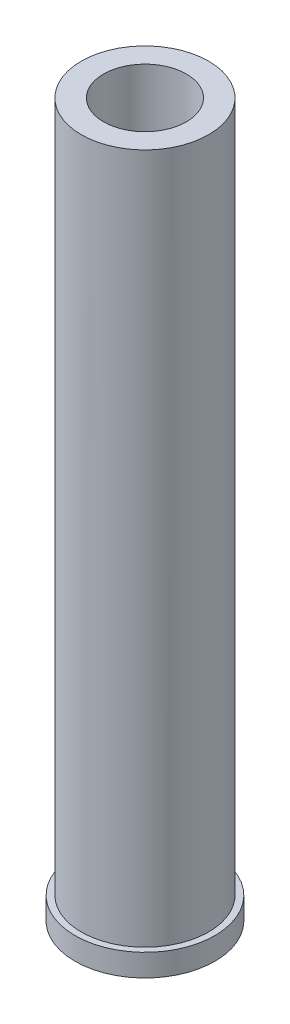
ISO-10303-21;
HEADER;
FILE_DESCRIPTION(('STEP AP214'),'2;1');
FILE_NAME('part.step','',(''),(''),'','','');
FILE_SCHEMA(('AUTOMOTIVE_DESIGN { 1 0 10303 214 1 1 1 1 }'));
ENDSEC;
DATA;
#1=APPLICATION_CONTEXT('core data for automotive mechanical design processes');
#2=APPLICATION_PROTOCOL_DEFINITION('international standard','automotive_design',2000,#1);
#3=PRODUCT_CONTEXT('',#1,'mechanical');
#4=PRODUCT('Part','Part','',(#3));
#5=PRODUCT_RELATED_PRODUCT_CATEGORY('part','',(#4));
#6=PRODUCT_DEFINITION_FORMATION('','',#4);
#7=PRODUCT_DEFINITION_CONTEXT('part definition',#1,'design');
#8=PRODUCT_DEFINITION('design','',#6,#7);
#9=PRODUCT_DEFINITION_SHAPE('','',#8);
#10=(LENGTH_UNIT() NAMED_UNIT(*) SI_UNIT(.MILLI.,.METRE.));
#11=(NAMED_UNIT(*) PLANE_ANGLE_UNIT() SI_UNIT($,.RADIAN.));
#12=(NAMED_UNIT(*) SI_UNIT($,.STERADIAN.) SOLID_ANGLE_UNIT());
#13=UNCERTAINTY_MEASURE_WITH_UNIT(LENGTH_MEASURE(1.E-05),#10,'distance_accuracy_value','');
#14=(GEOMETRIC_REPRESENTATION_CONTEXT(3) GLOBAL_UNCERTAINTY_ASSIGNED_CONTEXT((#13)) GLOBAL_UNIT_ASSIGNED_CONTEXT((#10,
#11,#12)) REPRESENTATION_CONTEXT('',''));
#15=CARTESIAN_POINT('',(0.,0.,0.));
#16=DIRECTION('',(0.,0.,1.));
#17=DIRECTION('',(1.,0.,0.));
#18=AXIS2_PLACEMENT_3D('',#15,#16,#17);
#19=CARTESIAN_POINT('',(0.,160.,0.));
#20=DIRECTION('',(0.,-1.,0.));
#21=DIRECTION('',(0.,0.,-1.));
#22=AXIS2_PLACEMENT_3D('',#19,#20,#21);
#23=CYLINDRICAL_SURFACE('',#22,14.3);
#24=CARTESIAN_POINT('',(0.,160.,0.));
#25=DIRECTION('',(0.,1.,0.));
#26=DIRECTION('',(0.,0.,1.));
#27=AXIS2_PLACEMENT_3D('',#24,#25,#26);
#28=CIRCLE('',#27,14.3);
#29=CARTESIAN_POINT('',(0.,160.,14.3));
#30=VERTEX_POINT('',#29);
#31=EDGE_CURVE('E54',#30,#30,#28,.T.);
#32=ORIENTED_EDGE('',*,*,#31,.F.);
#33=EDGE_LOOP('',(#32));
#34=FACE_BOUND('',#33,.T.);
#35=CARTESIAN_POINT('',(0.,5.,0.));
#36=DIRECTION('',(0.,-1.,0.));
#37=DIRECTION('',(0.,0.,-1.));
#38=AXIS2_PLACEMENT_3D('',#35,#36,#37);
#39=CIRCLE('',#38,14.3);
#40=CARTESIAN_POINT('',(0.,5.,-14.3));
#41=VERTEX_POINT('',#40);
#42=EDGE_CURVE('E10',#41,#41,#39,.T.);
#43=ORIENTED_EDGE('',*,*,#42,.F.);
#44=EDGE_LOOP('',(#43));
#45=FACE_BOUND('',#44,.T.);
#46=ADVANCED_FACE('F47',(#34,#45),#23,.T.);
#47=CARTESIAN_POINT('',(0.,160.,0.));
#48=DIRECTION('',(0.,1.,0.));
#49=DIRECTION('',(0.,0.,1.));
#50=AXIS2_PLACEMENT_3D('',#47,#48,#49);
#51=PLANE('',#50);
#52=ORIENTED_EDGE('',*,*,#31,.T.);
#53=EDGE_LOOP('',(#52));
#54=FACE_BOUND('',#53,.T.);
#55=CARTESIAN_POINT('',(0.,160.,0.));
#56=DIRECTION('',(0.,1.,0.));
#57=DIRECTION('',(0.,0.,1.));
#58=AXIS2_PLACEMENT_3D('',#55,#56,#57);
#59=CIRCLE('',#58,9.3);
#60=CARTESIAN_POINT('',(0.,160.,9.3));
#61=VERTEX_POINT('',#60);
#62=EDGE_CURVE('E59',#61,#61,#59,.T.);
#63=ORIENTED_EDGE('',*,*,#62,.F.);
#64=EDGE_LOOP('',(#63));
#65=FACE_BOUND('',#64,.T.);
#66=ADVANCED_FACE('F85',(#54,#65),#51,.T.);
#67=CARTESIAN_POINT('',(0.,0.,0.));
#68=DIRECTION('',(0.,1.,0.));
#69=DIRECTION('',(0.,0.,1.));
#70=AXIS2_PLACEMENT_3D('',#67,#68,#69);
#71=PLANE('',#70);
#72=CARTESIAN_POINT('',(0.,0.,0.));
#73=DIRECTION('',(0.,1.,0.));
#74=DIRECTION('',(0.,0.,1.));
#75=AXIS2_PLACEMENT_3D('',#72,#73,#74);
#76=CIRCLE('',#75,9.3);
#77=CARTESIAN_POINT('',(0.,0.,9.3));
#78=VERTEX_POINT('',#77);
#79=EDGE_CURVE('E64',#78,#78,#76,.T.);
#80=ORIENTED_EDGE('',*,*,#79,.T.);
#81=EDGE_LOOP('',(#80));
#82=FACE_BOUND('',#81,.T.);
#83=CARTESIAN_POINT('',(0.,0.,0.));
#84=DIRECTION('',(0.,1.,0.));
#85=DIRECTION('',(0.,0.,1.));
#86=AXIS2_PLACEMENT_3D('',#83,#84,#85);
#87=CIRCLE('',#86,15.7);
#88=CARTESIAN_POINT('',(0.,0.,15.7));
#89=VERTEX_POINT('',#88);
#90=EDGE_CURVE('E74',#89,#89,#87,.T.);
#91=ORIENTED_EDGE('',*,*,#90,.F.);
#92=EDGE_LOOP('',(#91));
#93=FACE_BOUND('',#92,.T.);
#94=ADVANCED_FACE('F82',(#82,#93),#71,.F.);
#95=CARTESIAN_POINT('',(0.,160.,0.));
#96=DIRECTION('',(0.,-1.,0.));
#97=DIRECTION('',(0.,0.,-1.));
#98=AXIS2_PLACEMENT_3D('',#95,#96,#97);
#99=CYLINDRICAL_SURFACE('',#98,9.3);
#100=ORIENTED_EDGE('',*,*,#62,.T.);
#101=EDGE_LOOP('',(#100));
#102=FACE_BOUND('',#101,.T.);
#103=ORIENTED_EDGE('',*,*,#79,.F.);
#104=EDGE_LOOP('',(#103));
#105=FACE_BOUND('',#104,.T.);
#106=ADVANCED_FACE('F84',(#102,#105),#99,.F.);
#107=CARTESIAN_POINT('',(0.,5.,0.));
#108=DIRECTION('',(0.,-1.,0.));
#109=DIRECTION('',(0.,0.,-1.));
#110=AXIS2_PLACEMENT_3D('',#107,#108,#109);
#111=PLANE('',#110);
#112=ORIENTED_EDGE('',*,*,#42,.T.);
#113=EDGE_LOOP('',(#112));
#114=FACE_BOUND('',#113,.T.);
#115=CARTESIAN_POINT('',(0.,5.,0.));
#116=DIRECTION('',(0.,1.,0.));
#117=DIRECTION('',(0.,0.,1.));
#118=AXIS2_PLACEMENT_3D('',#115,#116,#117);
#119=CIRCLE('',#118,15.7);
#120=CARTESIAN_POINT('',(0.,5.,15.7));
#121=VERTEX_POINT('',#120);
#122=EDGE_CURVE('E69',#121,#121,#119,.T.);
#123=ORIENTED_EDGE('',*,*,#122,.T.);
#124=EDGE_LOOP('',(#123));
#125=FACE_BOUND('',#124,.T.);
#126=ADVANCED_FACE('F92',(#114,#125),#111,.F.);
#127=CARTESIAN_POINT('',(0.,300.,0.));
#128=DIRECTION('',(0.,1.,0.));
#129=DIRECTION('',(0.,0.,1.));
#130=AXIS2_PLACEMENT_3D('',#127,#128,#129);
#131=CYLINDRICAL_SURFACE('',#130,15.7);
#132=ORIENTED_EDGE('',*,*,#90,.T.);
#133=EDGE_LOOP('',(#132));
#134=FACE_BOUND('',#133,.T.);
#135=ORIENTED_EDGE('',*,*,#122,.F.);
#136=EDGE_LOOP('',(#135));
#137=FACE_BOUND('',#136,.T.);
#138=ADVANCED_FACE('F79',(#134,#137),#131,.T.);
#139=CLOSED_SHELL('',(#46,#66,#94,#106,#126,#138));
#140=MANIFOLD_SOLID_BREP('B2',#139);
#141=ADVANCED_BREP_SHAPE_REPRESENTATION('',(#18,#140),#14);
#142=SHAPE_DEFINITION_REPRESENTATION(#9,#141);
ENDSEC;
END-ISO-10303-21;
